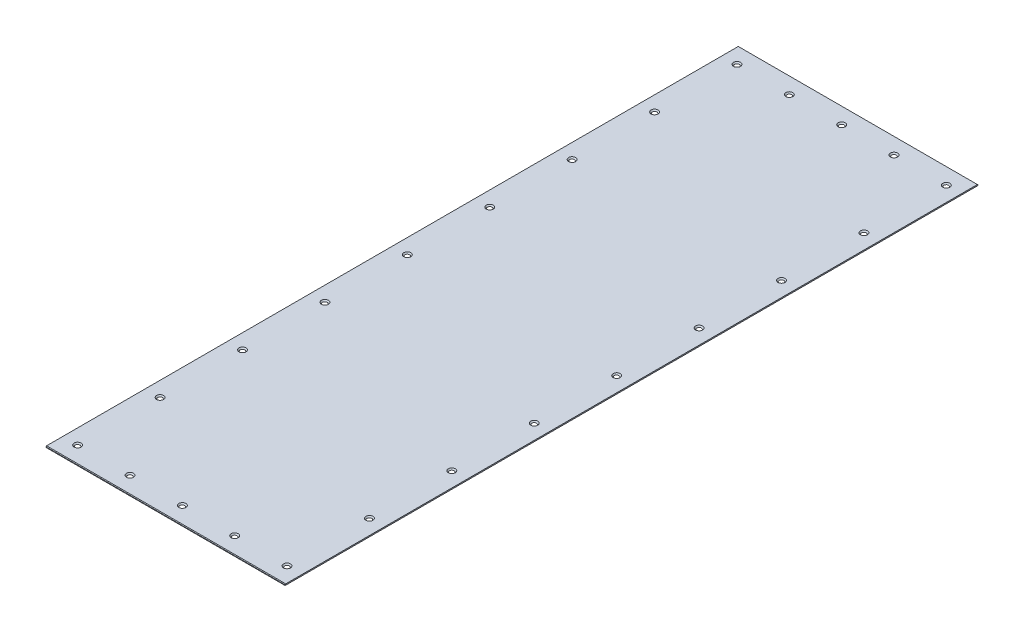
ISO-10303-21;
HEADER;
FILE_DESCRIPTION(('STEP AP214'),'2;1');
FILE_NAME('part.step','',(''),(''),'','','');
FILE_SCHEMA(('AUTOMOTIVE_DESIGN { 1 0 10303 214 1 1 1 1 }'));
ENDSEC;
DATA;
#1=APPLICATION_CONTEXT('core data for automotive mechanical design processes');
#2=APPLICATION_PROTOCOL_DEFINITION('international standard','automotive_design',2000,#1);
#3=PRODUCT_CONTEXT('',#1,'mechanical');
#4=PRODUCT('Part','Part','',(#3));
#5=PRODUCT_RELATED_PRODUCT_CATEGORY('part','',(#4));
#6=PRODUCT_DEFINITION_FORMATION('','',#4);
#7=PRODUCT_DEFINITION_CONTEXT('part definition',#1,'design');
#8=PRODUCT_DEFINITION('design','',#6,#7);
#9=PRODUCT_DEFINITION_SHAPE('','',#8);
#10=(LENGTH_UNIT() NAMED_UNIT(*) SI_UNIT(.MILLI.,.METRE.));
#11=(NAMED_UNIT(*) PLANE_ANGLE_UNIT() SI_UNIT($,.RADIAN.));
#12=(NAMED_UNIT(*) SI_UNIT($,.STERADIAN.) SOLID_ANGLE_UNIT());
#13=UNCERTAINTY_MEASURE_WITH_UNIT(LENGTH_MEASURE(1.E-05),#10,'distance_accuracy_value','');
#14=(GEOMETRIC_REPRESENTATION_CONTEXT(3) GLOBAL_UNCERTAINTY_ASSIGNED_CONTEXT((#13)) GLOBAL_UNIT_ASSIGNED_CONTEXT((#10,
#11,#12)) REPRESENTATION_CONTEXT('',''));
#15=CARTESIAN_POINT('',(0.,0.,0.));
#16=DIRECTION('',(0.,0.,1.));
#17=DIRECTION('',(1.,0.,0.));
#18=AXIS2_PLACEMENT_3D('',#15,#16,#17);
#19=CARTESIAN_POINT('',(160.5,1.5875,-465.));
#20=DIRECTION('',(0.,-1.,0.));
#21=DIRECTION('',(0.,0.,-1.));
#22=AXIS2_PLACEMENT_3D('',#19,#20,#21);
#23=PLANE('',#22);
#24=CARTESIAN_POINT('',(-70.25,1.5875,-442.5));
#25=DIRECTION('',(0.,1.,0.));
#26=DIRECTION('',(0.,0.,1.));
#27=AXIS2_PLACEMENT_3D('',#24,#25,#26);
#28=CIRCLE('',#27,4.7);
#29=CARTESIAN_POINT('',(-70.25,1.5875,-437.8));
#30=VERTEX_POINT('',#29);
#31=EDGE_CURVE('E219',#30,#30,#28,.T.);
#32=ORIENTED_EDGE('',*,*,#31,.F.);
#33=EDGE_LOOP('',(#32));
#34=FACE_BOUND('',#33,.T.);
#35=CARTESIAN_POINT('',(70.25,1.5875,-442.5));
#36=DIRECTION('',(0.,1.,0.));
#37=DIRECTION('',(0.,0.,1.));
#38=AXIS2_PLACEMENT_3D('',#35,#36,#37);
#39=CIRCLE('',#38,4.7);
#40=CARTESIAN_POINT('',(70.25,1.5875,-437.8));
#41=VERTEX_POINT('',#40);
#42=EDGE_CURVE('E213',#41,#41,#39,.T.);
#43=ORIENTED_EDGE('',*,*,#42,.F.);
#44=EDGE_LOOP('',(#43));
#45=FACE_BOUND('',#44,.T.);
#46=CARTESIAN_POINT('',(-140.5,1.5875,-331.875));
#47=DIRECTION('',(0.,1.,0.));
#48=DIRECTION('',(0.,0.,1.));
#49=AXIS2_PLACEMENT_3D('',#46,#47,#48);
#50=CIRCLE('',#49,4.70000000000001);
#51=CARTESIAN_POINT('',(-140.5,1.5875,-327.175));
#52=VERTEX_POINT('',#51);
#53=EDGE_CURVE('E205',#52,#52,#50,.T.);
#54=ORIENTED_EDGE('',*,*,#53,.F.);
#55=EDGE_LOOP('',(#54));
#56=FACE_BOUND('',#55,.T.);
#57=CARTESIAN_POINT('',(140.5,1.5875,-221.25));
#58=DIRECTION('',(0.,1.,0.));
#59=DIRECTION('',(0.,0.,1.));
#60=AXIS2_PLACEMENT_3D('',#57,#58,#59);
#61=CIRCLE('',#60,4.70000000000001);
#62=CARTESIAN_POINT('',(140.5,1.5875,-216.55));
#63=VERTEX_POINT('',#62);
#64=EDGE_CURVE('E193',#63,#63,#61,.T.);
#65=ORIENTED_EDGE('',*,*,#64,.F.);
#66=EDGE_LOOP('',(#65));
#67=FACE_BOUND('',#66,.T.);
#68=CARTESIAN_POINT('',(-140.5,1.5875,-110.625));
#69=DIRECTION('',(0.,1.,0.));
#70=DIRECTION('',(0.,0.,1.));
#71=AXIS2_PLACEMENT_3D('',#68,#69,#70);
#72=CIRCLE('',#71,4.70000000000001);
#73=CARTESIAN_POINT('',(-140.5,1.5875,-105.925));
#74=VERTEX_POINT('',#73);
#75=EDGE_CURVE('E189',#74,#74,#72,.T.);
#76=ORIENTED_EDGE('',*,*,#75,.F.);
#77=EDGE_LOOP('',(#76));
#78=FACE_BOUND('',#77,.T.);
#79=CARTESIAN_POINT('',(140.5,1.5875,0.));
#80=DIRECTION('',(0.,1.,0.));
#81=DIRECTION('',(0.,0.,1.));
#82=AXIS2_PLACEMENT_3D('',#79,#80,#81);
#83=CIRCLE('',#82,4.70000000000001);
#84=CARTESIAN_POINT('',(140.5,1.5875,4.70000000000004));
#85=VERTEX_POINT('',#84);
#86=EDGE_CURVE('E177',#85,#85,#83,.T.);
#87=ORIENTED_EDGE('',*,*,#86,.F.);
#88=EDGE_LOOP('',(#87));
#89=FACE_BOUND('',#88,.T.);
#90=CARTESIAN_POINT('',(-140.5,1.5875,221.25));
#91=DIRECTION('',(0.,1.,0.));
#92=DIRECTION('',(0.,0.,1.));
#93=AXIS2_PLACEMENT_3D('',#90,#91,#92);
#94=CIRCLE('',#93,4.70000000000001);
#95=CARTESIAN_POINT('',(-140.5,1.5875,225.95));
#96=VERTEX_POINT('',#95);
#97=EDGE_CURVE('E169',#96,#96,#94,.T.);
#98=ORIENTED_EDGE('',*,*,#97,.F.);
#99=EDGE_LOOP('',(#98));
#100=FACE_BOUND('',#99,.T.);
#101=CARTESIAN_POINT('',(140.5,1.5875,110.625));
#102=DIRECTION('',(0.,1.,0.));
#103=DIRECTION('',(0.,0.,1.));
#104=AXIS2_PLACEMENT_3D('',#101,#102,#103);
#105=CIRCLE('',#104,4.70000000000001);
#106=CARTESIAN_POINT('',(140.5,1.5875,115.325));
#107=VERTEX_POINT('',#106);
#108=EDGE_CURVE('E161',#107,#107,#105,.T.);
#109=ORIENTED_EDGE('',*,*,#108,.F.);
#110=EDGE_LOOP('',(#109));
#111=FACE_BOUND('',#110,.T.);
#112=CARTESIAN_POINT('',(140.5,1.5875,221.25));
#113=DIRECTION('',(0.,1.,0.));
#114=DIRECTION('',(0.,0.,1.));
#115=AXIS2_PLACEMENT_3D('',#112,#113,#114);
#116=CIRCLE('',#115,4.70000000000001);
#117=CARTESIAN_POINT('',(140.5,1.5875,225.95));
#118=VERTEX_POINT('',#117);
#119=EDGE_CURVE('E157',#118,#118,#116,.T.);
#120=ORIENTED_EDGE('',*,*,#119,.F.);
#121=EDGE_LOOP('',(#120));
#122=FACE_BOUND('',#121,.T.);
#123=CARTESIAN_POINT('',(140.5,1.5875,331.875));
#124=DIRECTION('',(0.,1.,0.));
#125=DIRECTION('',(0.,0.,1.));
#126=AXIS2_PLACEMENT_3D('',#123,#124,#125);
#127=CIRCLE('',#126,4.70000000000001);
#128=CARTESIAN_POINT('',(140.5,1.5875,336.575));
#129=VERTEX_POINT('',#128);
#130=EDGE_CURVE('E153',#129,#129,#127,.T.);
#131=ORIENTED_EDGE('',*,*,#130,.F.);
#132=EDGE_LOOP('',(#131));
#133=FACE_BOUND('',#132,.T.);
#134=CARTESIAN_POINT('',(-140.5,1.5875,442.5));
#135=DIRECTION('',(0.,1.,0.));
#136=DIRECTION('',(0.,0.,1.));
#137=AXIS2_PLACEMENT_3D('',#134,#135,#136);
#138=CIRCLE('',#137,4.70000000000001);
#139=CARTESIAN_POINT('',(-140.5,1.5875,447.2));
#140=VERTEX_POINT('',#139);
#141=EDGE_CURVE('E149',#140,#140,#138,.T.);
#142=ORIENTED_EDGE('',*,*,#141,.F.);
#143=EDGE_LOOP('',(#142));
#144=FACE_BOUND('',#143,.T.);
#145=CARTESIAN_POINT('',(-70.25,1.5875,442.5));
#146=DIRECTION('',(0.,1.,0.));
#147=DIRECTION('',(0.,0.,1.));
#148=AXIS2_PLACEMENT_3D('',#145,#146,#147);
#149=CIRCLE('',#148,4.7);
#150=CARTESIAN_POINT('',(-70.25,1.5875,447.2));
#151=VERTEX_POINT('',#150);
#152=EDGE_CURVE('E145',#151,#151,#149,.T.);
#153=ORIENTED_EDGE('',*,*,#152,.F.);
#154=EDGE_LOOP('',(#153));
#155=FACE_BOUND('',#154,.T.);
#156=CARTESIAN_POINT('',(0.,1.5875,442.5));
#157=DIRECTION('',(0.,1.,0.));
#158=DIRECTION('',(0.,0.,1.));
#159=AXIS2_PLACEMENT_3D('',#156,#157,#158);
#160=CIRCLE('',#159,4.7);
#161=CARTESIAN_POINT('',(0.,1.5875,447.2));
#162=VERTEX_POINT('',#161);
#163=EDGE_CURVE('E141',#162,#162,#160,.T.);
#164=ORIENTED_EDGE('',*,*,#163,.F.);
#165=EDGE_LOOP('',(#164));
#166=FACE_BOUND('',#165,.T.);
#167=CARTESIAN_POINT('',(70.25,1.5875,442.5));
#168=DIRECTION('',(0.,1.,0.));
#169=DIRECTION('',(0.,0.,1.));
#170=AXIS2_PLACEMENT_3D('',#167,#168,#169);
#171=CIRCLE('',#170,4.7);
#172=CARTESIAN_POINT('',(70.25,1.5875,447.2));
#173=VERTEX_POINT('',#172);
#174=EDGE_CURVE('E137',#173,#173,#171,.T.);
#175=ORIENTED_EDGE('',*,*,#174,.F.);
#176=EDGE_LOOP('',(#175));
#177=FACE_BOUND('',#176,.T.);
#178=CARTESIAN_POINT('',(140.5,1.5875,442.5));
#179=DIRECTION('',(0.,1.,0.));
#180=DIRECTION('',(0.,0.,1.));
#181=AXIS2_PLACEMENT_3D('',#178,#179,#180);
#182=CIRCLE('',#181,4.70000000000001);
#183=CARTESIAN_POINT('',(140.5,1.5875,447.2));
#184=VERTEX_POINT('',#183);
#185=EDGE_CURVE('E108',#184,#184,#182,.T.);
#186=ORIENTED_EDGE('',*,*,#185,.F.);
#187=EDGE_LOOP('',(#186));
#188=FACE_BOUND('',#187,.T.);
#189=DIRECTION('',(0.,0.,-1.));
#190=VECTOR('',#189,1.);
#191=CARTESIAN_POINT('',(160.5,1.5875,465.));
#192=LINE('',#191,#190);
#193=CARTESIAN_POINT('',(160.5,1.5875,464.20625));
#194=VERTEX_POINT('',#193);
#195=CARTESIAN_POINT('',(160.5,1.58750000000011,-464.20625));
#196=VERTEX_POINT('',#195);
#197=EDGE_CURVE('E117',#194,#196,#192,.T.);
#198=ORIENTED_EDGE('',*,*,#197,.T.);
#199=DIRECTION('',(-1.,0.,0.));
#200=VECTOR('',#199,1.);
#201=CARTESIAN_POINT('',(160.5,1.5875,-464.20625));
#202=LINE('',#201,#200);
#203=CARTESIAN_POINT('',(-160.5,1.58750000000011,-464.20625));
#204=VERTEX_POINT('',#203);
#205=EDGE_CURVE('E124',#196,#204,#202,.T.);
#206=ORIENTED_EDGE('',*,*,#205,.T.);
#207=DIRECTION('',(0.,0.,1.));
#208=VECTOR('',#207,1.);
#209=CARTESIAN_POINT('',(-160.5,1.5875,465.));
#210=LINE('',#209,#208);
#211=CARTESIAN_POINT('',(-160.5,1.5875,464.20625));
#212=VERTEX_POINT('',#211);
#213=EDGE_CURVE('E111',#204,#212,#210,.T.);
#214=ORIENTED_EDGE('',*,*,#213,.T.);
#215=DIRECTION('',(1.,0.,0.));
#216=VECTOR('',#215,1.);
#217=CARTESIAN_POINT('',(160.5,1.5875,464.20625));
#218=LINE('',#217,#216);
#219=EDGE_CURVE('E91',#212,#194,#218,.T.);
#220=ORIENTED_EDGE('',*,*,#219,.T.);
#221=EDGE_LOOP('',(#198,#206,#214,#220));
#222=FACE_BOUND('',#221,.T.);
#223=CARTESIAN_POINT('',(-140.5,1.5875,331.875));
#224=DIRECTION('',(0.,1.,0.));
#225=DIRECTION('',(0.,0.,1.));
#226=AXIS2_PLACEMENT_3D('',#223,#224,#225);
#227=CIRCLE('',#226,4.70000000000001);
#228=CARTESIAN_POINT('',(-140.5,1.5875,336.575));
#229=VERTEX_POINT('',#228);
#230=EDGE_CURVE('E165',#229,#229,#227,.T.);
#231=ORIENTED_EDGE('',*,*,#230,.F.);
#232=EDGE_LOOP('',(#231));
#233=FACE_BOUND('',#232,.T.);
#234=CARTESIAN_POINT('',(-140.5,1.5875,110.625));
#235=DIRECTION('',(0.,1.,0.));
#236=DIRECTION('',(0.,0.,1.));
#237=AXIS2_PLACEMENT_3D('',#234,#235,#236);
#238=CIRCLE('',#237,4.70000000000001);
#239=CARTESIAN_POINT('',(-140.5,1.5875,115.325));
#240=VERTEX_POINT('',#239);
#241=EDGE_CURVE('E173',#240,#240,#238,.T.);
#242=ORIENTED_EDGE('',*,*,#241,.F.);
#243=EDGE_LOOP('',(#242));
#244=FACE_BOUND('',#243,.T.);
#245=CARTESIAN_POINT('',(-140.5,1.5875,0.));
#246=DIRECTION('',(0.,1.,0.));
#247=DIRECTION('',(0.,0.,1.));
#248=AXIS2_PLACEMENT_3D('',#245,#246,#247);
#249=CIRCLE('',#248,4.70000000000001);
#250=CARTESIAN_POINT('',(-140.5,1.5875,4.70000000000004));
#251=VERTEX_POINT('',#250);
#252=EDGE_CURVE('E181',#251,#251,#249,.T.);
#253=ORIENTED_EDGE('',*,*,#252,.F.);
#254=EDGE_LOOP('',(#253));
#255=FACE_BOUND('',#254,.T.);
#256=CARTESIAN_POINT('',(140.5,1.5875,-110.625));
#257=DIRECTION('',(0.,1.,0.));
#258=DIRECTION('',(0.,0.,1.));
#259=AXIS2_PLACEMENT_3D('',#256,#257,#258);
#260=CIRCLE('',#259,4.70000000000001);
#261=CARTESIAN_POINT('',(140.5,1.5875,-105.925));
#262=VERTEX_POINT('',#261);
#263=EDGE_CURVE('E185',#262,#262,#260,.T.);
#264=ORIENTED_EDGE('',*,*,#263,.F.);
#265=EDGE_LOOP('',(#264));
#266=FACE_BOUND('',#265,.T.);
#267=CARTESIAN_POINT('',(-140.5,1.5875,-221.25));
#268=DIRECTION('',(0.,1.,0.));
#269=DIRECTION('',(0.,0.,1.));
#270=AXIS2_PLACEMENT_3D('',#267,#268,#269);
#271=CIRCLE('',#270,4.70000000000001);
#272=CARTESIAN_POINT('',(-140.5,1.5875,-216.55));
#273=VERTEX_POINT('',#272);
#274=EDGE_CURVE('E197',#273,#273,#271,.T.);
#275=ORIENTED_EDGE('',*,*,#274,.F.);
#276=EDGE_LOOP('',(#275));
#277=FACE_BOUND('',#276,.T.);
#278=CARTESIAN_POINT('',(140.5,1.5875,-331.875));
#279=DIRECTION('',(0.,1.,0.));
#280=DIRECTION('',(0.,0.,1.));
#281=AXIS2_PLACEMENT_3D('',#278,#279,#280);
#282=CIRCLE('',#281,4.70000000000001);
#283=CARTESIAN_POINT('',(140.5,1.5875,-327.175));
#284=VERTEX_POINT('',#283);
#285=EDGE_CURVE('E201',#284,#284,#282,.T.);
#286=ORIENTED_EDGE('',*,*,#285,.F.);
#287=EDGE_LOOP('',(#286));
#288=FACE_BOUND('',#287,.T.);
#289=CARTESIAN_POINT('',(140.5,1.5875,-442.5));
#290=DIRECTION('',(0.,1.,0.));
#291=DIRECTION('',(0.,0.,1.));
#292=AXIS2_PLACEMENT_3D('',#289,#290,#291);
#293=CIRCLE('',#292,4.70000000000001);
#294=CARTESIAN_POINT('',(140.5,1.5875,-437.8));
#295=VERTEX_POINT('',#294);
#296=EDGE_CURVE('E209',#295,#295,#293,.T.);
#297=ORIENTED_EDGE('',*,*,#296,.F.);
#298=EDGE_LOOP('',(#297));
#299=FACE_BOUND('',#298,.T.);
#300=CARTESIAN_POINT('',(0.,1.5875,-442.5));
#301=DIRECTION('',(0.,1.,0.));
#302=DIRECTION('',(0.,0.,1.));
#303=AXIS2_PLACEMENT_3D('',#300,#301,#302);
#304=CIRCLE('',#303,4.7);
#305=CARTESIAN_POINT('',(0.,1.5875,-437.8));
#306=VERTEX_POINT('',#305);
#307=EDGE_CURVE('E216',#306,#306,#304,.T.);
#308=ORIENTED_EDGE('',*,*,#307,.F.);
#309=EDGE_LOOP('',(#308));
#310=FACE_BOUND('',#309,.T.);
#311=CARTESIAN_POINT('',(-140.5,1.5875,-442.5));
#312=DIRECTION('',(0.,1.,0.));
#313=DIRECTION('',(0.,0.,1.));
#314=AXIS2_PLACEMENT_3D('',#311,#312,#313);
#315=CIRCLE('',#314,4.70000000000001);
#316=CARTESIAN_POINT('',(-140.5,1.5875,-437.8));
#317=VERTEX_POINT('',#316);
#318=EDGE_CURVE('E229',#317,#317,#315,.T.);
#319=ORIENTED_EDGE('',*,*,#318,.F.);
#320=EDGE_LOOP('',(#319));
#321=FACE_BOUND('',#320,.T.);
#322=ADVANCED_FACE('F31',(#34,#45,#56,#67,#78,#89,#100,#111,#122,#133,#144,#155,#166,#177,#188,
#222,#233,#244,#255,#266,#277,#288,#299,#310,#321),#23,.F.);
#323=CARTESIAN_POINT('',(160.5,1.5875,465.));
#324=DIRECTION('',(-1.,0.,0.));
#325=DIRECTION('',(0.,0.,1.));
#326=AXIS2_PLACEMENT_3D('',#323,#324,#325);
#327=PLANE('',#326);
#328=DIRECTION('',(0.,-1.,0.));
#329=VECTOR('',#328,1.);
#330=CARTESIAN_POINT('',(160.5,1.5875,-465.));
#331=LINE('',#330,#329);
#332=CARTESIAN_POINT('',(160.5,0.793749999999962,-465.));
#333=VERTEX_POINT('',#332);
#334=CARTESIAN_POINT('',(160.5,0.,-465.));
#335=VERTEX_POINT('',#334);
#336=EDGE_CURVE('E84',#333,#335,#331,.T.);
#337=ORIENTED_EDGE('',*,*,#336,.F.);
#338=DIRECTION('',(0.,-0.707106781186548,-0.707106781186548));
#339=VECTOR('',#338,1.);
#340=CARTESIAN_POINT('',(160.5,1.5875,-464.20625));
#341=LINE('',#340,#339);
#342=EDGE_CURVE('E40',#333,#196,#341,.F.);
#343=ORIENTED_EDGE('',*,*,#342,.T.);
#344=ORIENTED_EDGE('',*,*,#197,.F.);
#345=DIRECTION('',(0.,0.707106781186548,-0.707106781186548));
#346=VECTOR('',#345,1.);
#347=CARTESIAN_POINT('',(160.5,1.5875,464.20625));
#348=LINE('',#347,#346);
#349=CARTESIAN_POINT('',(160.5,0.793749999999962,465.));
#350=VERTEX_POINT('',#349);
#351=EDGE_CURVE('E48',#194,#350,#348,.F.);
#352=ORIENTED_EDGE('',*,*,#351,.T.);
#353=DIRECTION('',(0.,-1.,0.));
#354=VECTOR('',#353,1.);
#355=CARTESIAN_POINT('',(160.5,1.5875,465.));
#356=LINE('',#355,#354);
#357=CARTESIAN_POINT('',(160.5,0.,465.));
#358=VERTEX_POINT('',#357);
#359=EDGE_CURVE('E103',#350,#358,#356,.T.);
#360=ORIENTED_EDGE('',*,*,#359,.T.);
#361=DIRECTION('',(0.,0.,-1.));
#362=VECTOR('',#361,1.);
#363=CARTESIAN_POINT('',(160.5,0.,465.));
#364=LINE('',#363,#362);
#365=EDGE_CURVE('E98',#358,#335,#364,.T.);
#366=ORIENTED_EDGE('',*,*,#365,.T.);
#367=EDGE_LOOP('',(#337,#343,#344,#352,#360,#366));
#368=FACE_BOUND('',#367,.T.);
#369=ADVANCED_FACE('F102',(#368),#327,.F.);
#370=CARTESIAN_POINT('',(-160.5,1.5875,-465.));
#371=DIRECTION('',(0.,0.,1.));
#372=DIRECTION('',(1.,0.,0.));
#373=AXIS2_PLACEMENT_3D('',#370,#371,#372);
#374=PLANE('',#373);
#375=DIRECTION('',(0.,-1.,0.));
#376=VECTOR('',#375,1.);
#377=CARTESIAN_POINT('',(-160.5,1.5875,-465.));
#378=LINE('',#377,#376);
#379=CARTESIAN_POINT('',(-160.5,0.793749999999962,-465.));
#380=VERTEX_POINT('',#379);
#381=CARTESIAN_POINT('',(-160.5,0.,-465.));
#382=VERTEX_POINT('',#381);
#383=EDGE_CURVE('E92',#380,#382,#378,.T.);
#384=ORIENTED_EDGE('',*,*,#383,.F.);
#385=DIRECTION('',(1.,0.,0.));
#386=VECTOR('',#385,1.);
#387=CARTESIAN_POINT('',(-160.5,0.793749999999962,-465.));
#388=LINE('',#387,#386);
#389=EDGE_CURVE('E56',#380,#333,#388,.T.);
#390=ORIENTED_EDGE('',*,*,#389,.T.);
#391=ORIENTED_EDGE('',*,*,#336,.T.);
#392=DIRECTION('',(-1.,0.,0.));
#393=VECTOR('',#392,1.);
#394=CARTESIAN_POINT('',(-160.5,0.,-465.));
#395=LINE('',#394,#393);
#396=EDGE_CURVE('E87',#335,#382,#395,.T.);
#397=ORIENTED_EDGE('',*,*,#396,.T.);
#398=EDGE_LOOP('',(#384,#390,#391,#397));
#399=FACE_BOUND('',#398,.T.);
#400=ADVANCED_FACE('F86',(#399),#374,.F.);
#401=CARTESIAN_POINT('',(-160.5,1.5875,465.));
#402=DIRECTION('',(1.,0.,0.));
#403=DIRECTION('',(0.,0.,-1.));
#404=AXIS2_PLACEMENT_3D('',#401,#402,#403);
#405=PLANE('',#404);
#406=ORIENTED_EDGE('',*,*,#213,.F.);
#407=DIRECTION('',(0.,0.707106781186548,0.707106781186548));
#408=VECTOR('',#407,1.);
#409=CARTESIAN_POINT('',(-160.5,1.5875,-464.20625));
#410=LINE('',#409,#408);
#411=EDGE_CURVE('E129',#204,#380,#410,.F.);
#412=ORIENTED_EDGE('',*,*,#411,.T.);
#413=ORIENTED_EDGE('',*,*,#383,.T.);
#414=DIRECTION('',(0.,0.,1.));
#415=VECTOR('',#414,1.);
#416=CARTESIAN_POINT('',(-160.5,0.,465.));
#417=LINE('',#416,#415);
#418=CARTESIAN_POINT('',(-160.5,0.,465.));
#419=VERTEX_POINT('',#418);
#420=EDGE_CURVE('E100',#382,#419,#417,.T.);
#421=ORIENTED_EDGE('',*,*,#420,.T.);
#422=DIRECTION('',(0.,-1.,0.));
#423=VECTOR('',#422,1.);
#424=CARTESIAN_POINT('',(-160.5,1.5875,465.));
#425=LINE('',#424,#423);
#426=CARTESIAN_POINT('',(-160.5,0.793749999999962,465.));
#427=VERTEX_POINT('',#426);
#428=EDGE_CURVE('E119',#427,#419,#425,.T.);
#429=ORIENTED_EDGE('',*,*,#428,.F.);
#430=DIRECTION('',(0.,-0.707106781186548,0.707106781186548));
#431=VECTOR('',#430,1.);
#432=CARTESIAN_POINT('',(-160.5,1.5875,464.20625));
#433=LINE('',#432,#431);
#434=EDGE_CURVE('E127',#427,#212,#433,.F.);
#435=ORIENTED_EDGE('',*,*,#434,.T.);
#436=EDGE_LOOP('',(#406,#412,#413,#421,#429,#435));
#437=FACE_BOUND('',#436,.T.);
#438=ADVANCED_FACE('F287',(#437),#405,.F.);
#439=CARTESIAN_POINT('',(-160.5,1.5875,465.));
#440=DIRECTION('',(0.,0.,-1.));
#441=DIRECTION('',(-1.,0.,0.));
#442=AXIS2_PLACEMENT_3D('',#439,#440,#441);
#443=PLANE('',#442);
#444=ORIENTED_EDGE('',*,*,#359,.F.);
#445=DIRECTION('',(-1.,0.,0.));
#446=VECTOR('',#445,1.);
#447=CARTESIAN_POINT('',(-160.5,0.793749999999962,465.));
#448=LINE('',#447,#446);
#449=EDGE_CURVE('E11',#350,#427,#448,.T.);
#450=ORIENTED_EDGE('',*,*,#449,.T.);
#451=ORIENTED_EDGE('',*,*,#428,.T.);
#452=DIRECTION('',(1.,0.,0.));
#453=VECTOR('',#452,1.);
#454=CARTESIAN_POINT('',(-160.5,0.,465.));
#455=LINE('',#454,#453);
#456=EDGE_CURVE('E115',#419,#358,#455,.T.);
#457=ORIENTED_EDGE('',*,*,#456,.T.);
#458=EDGE_LOOP('',(#444,#450,#451,#457));
#459=FACE_BOUND('',#458,.T.);
#460=ADVANCED_FACE('F286',(#459),#443,.F.);
#461=CARTESIAN_POINT('',(160.5,0.,-465.));
#462=DIRECTION('',(0.,-1.,0.));
#463=DIRECTION('',(0.,0.,-1.));
#464=AXIS2_PLACEMENT_3D('',#461,#462,#463);
#465=PLANE('',#464);
#466=CARTESIAN_POINT('',(-140.5,0.,-442.5));
#467=DIRECTION('',(0.,-1.,0.));
#468=DIRECTION('',(0.,0.,-1.));
#469=AXIS2_PLACEMENT_3D('',#466,#467,#468);
#470=CIRCLE('',#469,3.11250000000001);
#471=CARTESIAN_POINT('',(-140.5,0.,-445.6125));
#472=VERTEX_POINT('',#471);
#473=EDGE_CURVE('E35',#472,#472,#470,.T.);
#474=ORIENTED_EDGE('',*,*,#473,.F.);
#475=EDGE_LOOP('',(#474));
#476=FACE_BOUND('',#475,.T.);
#477=CARTESIAN_POINT('',(-70.25,0.,-442.5));
#478=DIRECTION('',(0.,-1.,0.));
#479=DIRECTION('',(0.,0.,-1.));
#480=AXIS2_PLACEMENT_3D('',#477,#478,#479);
#481=CIRCLE('',#480,3.1125);
#482=CARTESIAN_POINT('',(-70.25,0.,-445.6125));
#483=VERTEX_POINT('',#482);
#484=EDGE_CURVE('E217',#483,#483,#481,.T.);
#485=ORIENTED_EDGE('',*,*,#484,.F.);
#486=EDGE_LOOP('',(#485));
#487=FACE_BOUND('',#486,.T.);
#488=CARTESIAN_POINT('',(0.,0.,-442.5));
#489=DIRECTION('',(0.,-1.,0.));
#490=DIRECTION('',(0.,0.,-1.));
#491=AXIS2_PLACEMENT_3D('',#488,#489,#490);
#492=CIRCLE('',#491,3.1125);
#493=CARTESIAN_POINT('',(0.,0.,-445.6125));
#494=VERTEX_POINT('',#493);
#495=EDGE_CURVE('E214',#494,#494,#492,.T.);
#496=ORIENTED_EDGE('',*,*,#495,.F.);
#497=EDGE_LOOP('',(#496));
#498=FACE_BOUND('',#497,.T.);
#499=CARTESIAN_POINT('',(70.25,0.,-442.5));
#500=DIRECTION('',(0.,-1.,0.));
#501=DIRECTION('',(0.,0.,-1.));
#502=AXIS2_PLACEMENT_3D('',#499,#500,#501);
#503=CIRCLE('',#502,3.1125);
#504=CARTESIAN_POINT('',(70.25,0.,-445.6125));
#505=VERTEX_POINT('',#504);
#506=EDGE_CURVE('E210',#505,#505,#503,.T.);
#507=ORIENTED_EDGE('',*,*,#506,.F.);
#508=EDGE_LOOP('',(#507));
#509=FACE_BOUND('',#508,.T.);
#510=CARTESIAN_POINT('',(140.5,0.,-442.5));
#511=DIRECTION('',(0.,-1.,0.));
#512=DIRECTION('',(0.,0.,-1.));
#513=AXIS2_PLACEMENT_3D('',#510,#511,#512);
#514=CIRCLE('',#513,3.11250000000001);
#515=CARTESIAN_POINT('',(140.5,0.,-445.6125));
#516=VERTEX_POINT('',#515);
#517=EDGE_CURVE('E206',#516,#516,#514,.T.);
#518=ORIENTED_EDGE('',*,*,#517,.F.);
#519=EDGE_LOOP('',(#518));
#520=FACE_BOUND('',#519,.T.);
#521=CARTESIAN_POINT('',(-140.5,0.,-331.875));
#522=DIRECTION('',(0.,-1.,0.));
#523=DIRECTION('',(0.,0.,-1.));
#524=AXIS2_PLACEMENT_3D('',#521,#522,#523);
#525=CIRCLE('',#524,3.11250000000001);
#526=CARTESIAN_POINT('',(-140.5,0.,-334.9875));
#527=VERTEX_POINT('',#526);
#528=EDGE_CURVE('E202',#527,#527,#525,.T.);
#529=ORIENTED_EDGE('',*,*,#528,.F.);
#530=EDGE_LOOP('',(#529));
#531=FACE_BOUND('',#530,.T.);
#532=CARTESIAN_POINT('',(140.5,0.,-331.875));
#533=DIRECTION('',(0.,-1.,0.));
#534=DIRECTION('',(0.,0.,-1.));
#535=AXIS2_PLACEMENT_3D('',#532,#533,#534);
#536=CIRCLE('',#535,3.11250000000001);
#537=CARTESIAN_POINT('',(140.5,0.,-334.9875));
#538=VERTEX_POINT('',#537);
#539=EDGE_CURVE('E198',#538,#538,#536,.T.);
#540=ORIENTED_EDGE('',*,*,#539,.F.);
#541=EDGE_LOOP('',(#540));
#542=FACE_BOUND('',#541,.T.);
#543=CARTESIAN_POINT('',(-140.5,0.,-221.25));
#544=DIRECTION('',(0.,-1.,0.));
#545=DIRECTION('',(0.,0.,-1.));
#546=AXIS2_PLACEMENT_3D('',#543,#544,#545);
#547=CIRCLE('',#546,3.11250000000001);
#548=CARTESIAN_POINT('',(-140.5,0.,-224.3625));
#549=VERTEX_POINT('',#548);
#550=EDGE_CURVE('E194',#549,#549,#547,.T.);
#551=ORIENTED_EDGE('',*,*,#550,.F.);
#552=EDGE_LOOP('',(#551));
#553=FACE_BOUND('',#552,.T.);
#554=CARTESIAN_POINT('',(140.5,0.,-221.25));
#555=DIRECTION('',(0.,-1.,0.));
#556=DIRECTION('',(0.,0.,-1.));
#557=AXIS2_PLACEMENT_3D('',#554,#555,#556);
#558=CIRCLE('',#557,3.11250000000001);
#559=CARTESIAN_POINT('',(140.5,0.,-224.3625));
#560=VERTEX_POINT('',#559);
#561=EDGE_CURVE('E190',#560,#560,#558,.T.);
#562=ORIENTED_EDGE('',*,*,#561,.F.);
#563=EDGE_LOOP('',(#562));
#564=FACE_BOUND('',#563,.T.);
#565=CARTESIAN_POINT('',(-140.5,0.,-110.625));
#566=DIRECTION('',(0.,-1.,0.));
#567=DIRECTION('',(0.,0.,-1.));
#568=AXIS2_PLACEMENT_3D('',#565,#566,#567);
#569=CIRCLE('',#568,3.11250000000001);
#570=CARTESIAN_POINT('',(-140.5,0.,-113.7375));
#571=VERTEX_POINT('',#570);
#572=EDGE_CURVE('E186',#571,#571,#569,.T.);
#573=ORIENTED_EDGE('',*,*,#572,.F.);
#574=EDGE_LOOP('',(#573));
#575=FACE_BOUND('',#574,.T.);
#576=CARTESIAN_POINT('',(140.5,0.,-110.625));
#577=DIRECTION('',(0.,-1.,0.));
#578=DIRECTION('',(0.,0.,-1.));
#579=AXIS2_PLACEMENT_3D('',#576,#577,#578);
#580=CIRCLE('',#579,3.11250000000001);
#581=CARTESIAN_POINT('',(140.5,0.,-113.7375));
#582=VERTEX_POINT('',#581);
#583=EDGE_CURVE('E182',#582,#582,#580,.T.);
#584=ORIENTED_EDGE('',*,*,#583,.F.);
#585=EDGE_LOOP('',(#584));
#586=FACE_BOUND('',#585,.T.);
#587=CARTESIAN_POINT('',(-140.5,0.,0.));
#588=DIRECTION('',(0.,-1.,0.));
#589=DIRECTION('',(0.,0.,-1.));
#590=AXIS2_PLACEMENT_3D('',#587,#588,#589);
#591=CIRCLE('',#590,3.11250000000001);
#592=CARTESIAN_POINT('',(-140.5,0.,-3.11249999999998));
#593=VERTEX_POINT('',#592);
#594=EDGE_CURVE('E178',#593,#593,#591,.T.);
#595=ORIENTED_EDGE('',*,*,#594,.F.);
#596=EDGE_LOOP('',(#595));
#597=FACE_BOUND('',#596,.T.);
#598=CARTESIAN_POINT('',(140.5,0.,0.));
#599=DIRECTION('',(0.,-1.,0.));
#600=DIRECTION('',(0.,0.,-1.));
#601=AXIS2_PLACEMENT_3D('',#598,#599,#600);
#602=CIRCLE('',#601,3.11250000000001);
#603=CARTESIAN_POINT('',(140.5,0.,-3.11249999999998));
#604=VERTEX_POINT('',#603);
#605=EDGE_CURVE('E174',#604,#604,#602,.T.);
#606=ORIENTED_EDGE('',*,*,#605,.F.);
#607=EDGE_LOOP('',(#606));
#608=FACE_BOUND('',#607,.T.);
#609=CARTESIAN_POINT('',(-140.5,0.,110.625));
#610=DIRECTION('',(0.,-1.,0.));
#611=DIRECTION('',(0.,0.,-1.));
#612=AXIS2_PLACEMENT_3D('',#609,#610,#611);
#613=CIRCLE('',#612,3.11250000000001);
#614=CARTESIAN_POINT('',(-140.5,0.,107.5125));
#615=VERTEX_POINT('',#614);
#616=EDGE_CURVE('E170',#615,#615,#613,.T.);
#617=ORIENTED_EDGE('',*,*,#616,.F.);
#618=EDGE_LOOP('',(#617));
#619=FACE_BOUND('',#618,.T.);
#620=CARTESIAN_POINT('',(-140.5,0.,221.25));
#621=DIRECTION('',(0.,-1.,0.));
#622=DIRECTION('',(0.,0.,-1.));
#623=AXIS2_PLACEMENT_3D('',#620,#621,#622);
#624=CIRCLE('',#623,3.11250000000001);
#625=CARTESIAN_POINT('',(-140.5,0.,218.1375));
#626=VERTEX_POINT('',#625);
#627=EDGE_CURVE('E166',#626,#626,#624,.T.);
#628=ORIENTED_EDGE('',*,*,#627,.F.);
#629=EDGE_LOOP('',(#628));
#630=FACE_BOUND('',#629,.T.);
#631=CARTESIAN_POINT('',(-140.5,0.,331.875));
#632=DIRECTION('',(0.,-1.,0.));
#633=DIRECTION('',(0.,0.,-1.));
#634=AXIS2_PLACEMENT_3D('',#631,#632,#633);
#635=CIRCLE('',#634,3.11250000000001);
#636=CARTESIAN_POINT('',(-140.5,0.,328.7625));
#637=VERTEX_POINT('',#636);
#638=EDGE_CURVE('E162',#637,#637,#635,.T.);
#639=ORIENTED_EDGE('',*,*,#638,.F.);
#640=EDGE_LOOP('',(#639));
#641=FACE_BOUND('',#640,.T.);
#642=CARTESIAN_POINT('',(140.5,0.,110.625));
#643=DIRECTION('',(0.,-1.,0.));
#644=DIRECTION('',(0.,0.,-1.));
#645=AXIS2_PLACEMENT_3D('',#642,#643,#644);
#646=CIRCLE('',#645,3.11250000000001);
#647=CARTESIAN_POINT('',(140.5,0.,107.5125));
#648=VERTEX_POINT('',#647);
#649=EDGE_CURVE('E158',#648,#648,#646,.T.);
#650=ORIENTED_EDGE('',*,*,#649,.F.);
#651=EDGE_LOOP('',(#650));
#652=FACE_BOUND('',#651,.T.);
#653=CARTESIAN_POINT('',(140.5,0.,221.25));
#654=DIRECTION('',(0.,-1.,0.));
#655=DIRECTION('',(0.,0.,-1.));
#656=AXIS2_PLACEMENT_3D('',#653,#654,#655);
#657=CIRCLE('',#656,3.11250000000001);
#658=CARTESIAN_POINT('',(140.5,0.,218.1375));
#659=VERTEX_POINT('',#658);
#660=EDGE_CURVE('E154',#659,#659,#657,.T.);
#661=ORIENTED_EDGE('',*,*,#660,.F.);
#662=EDGE_LOOP('',(#661));
#663=FACE_BOUND('',#662,.T.);
#664=CARTESIAN_POINT('',(140.5,0.,331.875));
#665=DIRECTION('',(0.,-1.,0.));
#666=DIRECTION('',(0.,0.,-1.));
#667=AXIS2_PLACEMENT_3D('',#664,#665,#666);
#668=CIRCLE('',#667,3.11250000000001);
#669=CARTESIAN_POINT('',(140.5,0.,328.7625));
#670=VERTEX_POINT('',#669);
#671=EDGE_CURVE('E150',#670,#670,#668,.T.);
#672=ORIENTED_EDGE('',*,*,#671,.F.);
#673=EDGE_LOOP('',(#672));
#674=FACE_BOUND('',#673,.T.);
#675=CARTESIAN_POINT('',(-140.5,0.,442.5));
#676=DIRECTION('',(0.,-1.,0.));
#677=DIRECTION('',(0.,0.,-1.));
#678=AXIS2_PLACEMENT_3D('',#675,#676,#677);
#679=CIRCLE('',#678,3.11250000000001);
#680=CARTESIAN_POINT('',(-140.5,0.,439.3875));
#681=VERTEX_POINT('',#680);
#682=EDGE_CURVE('E146',#681,#681,#679,.T.);
#683=ORIENTED_EDGE('',*,*,#682,.F.);
#684=EDGE_LOOP('',(#683));
#685=FACE_BOUND('',#684,.T.);
#686=CARTESIAN_POINT('',(-70.25,0.,442.5));
#687=DIRECTION('',(0.,-1.,0.));
#688=DIRECTION('',(0.,0.,-1.));
#689=AXIS2_PLACEMENT_3D('',#686,#687,#688);
#690=CIRCLE('',#689,3.1125);
#691=CARTESIAN_POINT('',(-70.25,0.,439.3875));
#692=VERTEX_POINT('',#691);
#693=EDGE_CURVE('E142',#692,#692,#690,.T.);
#694=ORIENTED_EDGE('',*,*,#693,.F.);
#695=EDGE_LOOP('',(#694));
#696=FACE_BOUND('',#695,.T.);
#697=CARTESIAN_POINT('',(0.,0.,442.5));
#698=DIRECTION('',(0.,-1.,0.));
#699=DIRECTION('',(0.,0.,-1.));
#700=AXIS2_PLACEMENT_3D('',#697,#698,#699);
#701=CIRCLE('',#700,3.1125);
#702=CARTESIAN_POINT('',(0.,0.,439.3875));
#703=VERTEX_POINT('',#702);
#704=EDGE_CURVE('E138',#703,#703,#701,.T.);
#705=ORIENTED_EDGE('',*,*,#704,.F.);
#706=EDGE_LOOP('',(#705));
#707=FACE_BOUND('',#706,.T.);
#708=CARTESIAN_POINT('',(70.25,0.,442.5));
#709=DIRECTION('',(0.,-1.,0.));
#710=DIRECTION('',(0.,0.,-1.));
#711=AXIS2_PLACEMENT_3D('',#708,#709,#710);
#712=CIRCLE('',#711,3.1125);
#713=CARTESIAN_POINT('',(70.25,0.,439.3875));
#714=VERTEX_POINT('',#713);
#715=EDGE_CURVE('E134',#714,#714,#712,.T.);
#716=ORIENTED_EDGE('',*,*,#715,.F.);
#717=EDGE_LOOP('',(#716));
#718=FACE_BOUND('',#717,.T.);
#719=CARTESIAN_POINT('',(140.5,0.,442.5));
#720=DIRECTION('',(0.,-1.,0.));
#721=DIRECTION('',(0.,0.,-1.));
#722=AXIS2_PLACEMENT_3D('',#719,#720,#721);
#723=CIRCLE('',#722,3.11250000000001);
#724=CARTESIAN_POINT('',(140.5,0.,439.3875));
#725=VERTEX_POINT('',#724);
#726=EDGE_CURVE('E105',#725,#725,#723,.T.);
#727=ORIENTED_EDGE('',*,*,#726,.F.);
#728=EDGE_LOOP('',(#727));
#729=FACE_BOUND('',#728,.T.);
#730=ORIENTED_EDGE('',*,*,#365,.F.);
#731=ORIENTED_EDGE('',*,*,#456,.F.);
#732=ORIENTED_EDGE('',*,*,#420,.F.);
#733=ORIENTED_EDGE('',*,*,#396,.F.);
#734=EDGE_LOOP('',(#730,#731,#732,#733));
#735=FACE_BOUND('',#734,.T.);
#736=ADVANCED_FACE('F96',(#476,#487,#498,#509,#520,#531,#542,#553,#564,#575,#586,#597,#608,#619,
#630,#641,#652,#663,#674,#685,#696,#707,#718,#729,#735),#465,.T.);
#737=CARTESIAN_POINT('',(160.5,1.5875,-464.20625));
#738=DIRECTION('',(0.,-0.707106781186548,0.707106781186548));
#739=DIRECTION('',(0.,-0.707106781186548,-0.707106781186548));
#740=AXIS2_PLACEMENT_3D('',#737,#738,#739);
#741=PLANE('',#740);
#742=ORIENTED_EDGE('',*,*,#342,.F.);
#743=ORIENTED_EDGE('',*,*,#389,.F.);
#744=ORIENTED_EDGE('',*,*,#411,.F.);
#745=ORIENTED_EDGE('',*,*,#205,.F.);
#746=EDGE_LOOP('',(#742,#743,#744,#745));
#747=FACE_BOUND('',#746,.T.);
#748=ADVANCED_FACE('F289',(#747),#741,.F.);
#749=CARTESIAN_POINT('',(160.5,1.5875,464.20625));
#750=DIRECTION('',(0.,-0.707106781186548,-0.707106781186548));
#751=DIRECTION('',(0.,0.707106781186548,-0.707106781186548));
#752=AXIS2_PLACEMENT_3D('',#749,#750,#751);
#753=PLANE('',#752);
#754=ORIENTED_EDGE('',*,*,#434,.F.);
#755=ORIENTED_EDGE('',*,*,#449,.F.);
#756=ORIENTED_EDGE('',*,*,#351,.F.);
#757=ORIENTED_EDGE('',*,*,#219,.F.);
#758=EDGE_LOOP('',(#754,#755,#756,#757));
#759=FACE_BOUND('',#758,.T.);
#760=ADVANCED_FACE('F33',(#759),#753,.F.);
#761=CARTESIAN_POINT('',(140.5,1.5875,442.5));
#762=DIRECTION('',(0.,1.,0.));
#763=DIRECTION('',(0.,0.,1.));
#764=AXIS2_PLACEMENT_3D('',#761,#762,#763);
#765=CONICAL_SURFACE('',#764,4.70000000000001,0.785398163397449);
#766=ORIENTED_EDGE('',*,*,#726,.T.);
#767=EDGE_LOOP('',(#766));
#768=FACE_BOUND('',#767,.T.);
#769=ORIENTED_EDGE('',*,*,#185,.T.);
#770=EDGE_LOOP('',(#769));
#771=FACE_BOUND('',#770,.T.);
#772=ADVANCED_FACE('F295',(#768,#771),#765,.F.);
#773=CARTESIAN_POINT('',(70.25,1.5875,442.5));
#774=DIRECTION('',(0.,1.,0.));
#775=DIRECTION('',(0.,0.,1.));
#776=AXIS2_PLACEMENT_3D('',#773,#774,#775);
#777=CONICAL_SURFACE('',#776,4.7,0.785398163397446);
#778=ORIENTED_EDGE('',*,*,#715,.T.);
#779=EDGE_LOOP('',(#778));
#780=FACE_BOUND('',#779,.T.);
#781=ORIENTED_EDGE('',*,*,#174,.T.);
#782=EDGE_LOOP('',(#781));
#783=FACE_BOUND('',#782,.T.);
#784=ADVANCED_FACE('F343',(#780,#783),#777,.F.);
#785=CARTESIAN_POINT('',(0.,1.5875,442.5));
#786=DIRECTION('',(0.,1.,0.));
#787=DIRECTION('',(0.,0.,1.));
#788=AXIS2_PLACEMENT_3D('',#785,#786,#787);
#789=CONICAL_SURFACE('',#788,4.7,0.785398163397448);
#790=ORIENTED_EDGE('',*,*,#704,.T.);
#791=EDGE_LOOP('',(#790));
#792=FACE_BOUND('',#791,.T.);
#793=ORIENTED_EDGE('',*,*,#163,.T.);
#794=EDGE_LOOP('',(#793));
#795=FACE_BOUND('',#794,.T.);
#796=ADVANCED_FACE('F352',(#792,#795),#789,.F.);
#797=CARTESIAN_POINT('',(-70.25,1.5875,442.5));
#798=DIRECTION('',(0.,1.,0.));
#799=DIRECTION('',(0.,0.,1.));
#800=AXIS2_PLACEMENT_3D('',#797,#798,#799);
#801=CONICAL_SURFACE('',#800,4.7,0.785398163397446);
#802=ORIENTED_EDGE('',*,*,#693,.T.);
#803=EDGE_LOOP('',(#802));
#804=FACE_BOUND('',#803,.T.);
#805=ORIENTED_EDGE('',*,*,#152,.T.);
#806=EDGE_LOOP('',(#805));
#807=FACE_BOUND('',#806,.T.);
#808=ADVANCED_FACE('F361',(#804,#807),#801,.F.);
#809=CARTESIAN_POINT('',(-140.5,1.5875,442.5));
#810=DIRECTION('',(0.,1.,0.));
#811=DIRECTION('',(0.,0.,1.));
#812=AXIS2_PLACEMENT_3D('',#809,#810,#811);
#813=CONICAL_SURFACE('',#812,4.70000000000001,0.785398163397449);
#814=ORIENTED_EDGE('',*,*,#682,.T.);
#815=EDGE_LOOP('',(#814));
#816=FACE_BOUND('',#815,.T.);
#817=ORIENTED_EDGE('',*,*,#141,.T.);
#818=EDGE_LOOP('',(#817));
#819=FACE_BOUND('',#818,.T.);
#820=ADVANCED_FACE('F371',(#816,#819),#813,.F.);
#821=CARTESIAN_POINT('',(140.5,1.5875,331.875));
#822=DIRECTION('',(0.,1.,0.));
#823=DIRECTION('',(0.,0.,1.));
#824=AXIS2_PLACEMENT_3D('',#821,#822,#823);
#825=CONICAL_SURFACE('',#824,4.70000000000001,0.785398163397449);
#826=ORIENTED_EDGE('',*,*,#671,.T.);
#827=EDGE_LOOP('',(#826));
#828=FACE_BOUND('',#827,.T.);
#829=ORIENTED_EDGE('',*,*,#130,.T.);
#830=EDGE_LOOP('',(#829));
#831=FACE_BOUND('',#830,.T.);
#832=ADVANCED_FACE('F381',(#828,#831),#825,.F.);
#833=CARTESIAN_POINT('',(140.5,1.5875,221.25));
#834=DIRECTION('',(0.,1.,0.));
#835=DIRECTION('',(0.,0.,1.));
#836=AXIS2_PLACEMENT_3D('',#833,#834,#835);
#837=CONICAL_SURFACE('',#836,4.70000000000001,0.785398163397449);
#838=ORIENTED_EDGE('',*,*,#660,.T.);
#839=EDGE_LOOP('',(#838));
#840=FACE_BOUND('',#839,.T.);
#841=ORIENTED_EDGE('',*,*,#119,.T.);
#842=EDGE_LOOP('',(#841));
#843=FACE_BOUND('',#842,.T.);
#844=ADVANCED_FACE('F391',(#840,#843),#837,.F.);
#845=CARTESIAN_POINT('',(140.5,1.5875,110.625));
#846=DIRECTION('',(0.,1.,0.));
#847=DIRECTION('',(0.,0.,1.));
#848=AXIS2_PLACEMENT_3D('',#845,#846,#847);
#849=CONICAL_SURFACE('',#848,4.70000000000001,0.785398163397449);
#850=ORIENTED_EDGE('',*,*,#649,.T.);
#851=EDGE_LOOP('',(#850));
#852=FACE_BOUND('',#851,.T.);
#853=ORIENTED_EDGE('',*,*,#108,.T.);
#854=EDGE_LOOP('',(#853));
#855=FACE_BOUND('',#854,.T.);
#856=ADVANCED_FACE('F401',(#852,#855),#849,.F.);
#857=CARTESIAN_POINT('',(-140.5,1.5875,331.875));
#858=DIRECTION('',(0.,1.,0.));
#859=DIRECTION('',(0.,0.,1.));
#860=AXIS2_PLACEMENT_3D('',#857,#858,#859);
#861=CONICAL_SURFACE('',#860,4.70000000000001,0.785398163397449);
#862=ORIENTED_EDGE('',*,*,#638,.T.);
#863=EDGE_LOOP('',(#862));
#864=FACE_BOUND('',#863,.T.);
#865=ORIENTED_EDGE('',*,*,#230,.T.);
#866=EDGE_LOOP('',(#865));
#867=FACE_BOUND('',#866,.T.);
#868=ADVANCED_FACE('F411',(#864,#867),#861,.F.);
#869=CARTESIAN_POINT('',(-140.5,1.5875,221.25));
#870=DIRECTION('',(0.,1.,0.));
#871=DIRECTION('',(0.,0.,1.));
#872=AXIS2_PLACEMENT_3D('',#869,#870,#871);
#873=CONICAL_SURFACE('',#872,4.70000000000001,0.785398163397449);
#874=ORIENTED_EDGE('',*,*,#627,.T.);
#875=EDGE_LOOP('',(#874));
#876=FACE_BOUND('',#875,.T.);
#877=ORIENTED_EDGE('',*,*,#97,.T.);
#878=EDGE_LOOP('',(#877));
#879=FACE_BOUND('',#878,.T.);
#880=ADVANCED_FACE('F421',(#876,#879),#873,.F.);
#881=CARTESIAN_POINT('',(-140.5,1.5875,110.625));
#882=DIRECTION('',(0.,1.,0.));
#883=DIRECTION('',(0.,0.,1.));
#884=AXIS2_PLACEMENT_3D('',#881,#882,#883);
#885=CONICAL_SURFACE('',#884,4.70000000000001,0.785398163397449);
#886=ORIENTED_EDGE('',*,*,#616,.T.);
#887=EDGE_LOOP('',(#886));
#888=FACE_BOUND('',#887,.T.);
#889=ORIENTED_EDGE('',*,*,#241,.T.);
#890=EDGE_LOOP('',(#889));
#891=FACE_BOUND('',#890,.T.);
#892=ADVANCED_FACE('F431',(#888,#891),#885,.F.);
#893=CARTESIAN_POINT('',(140.5,1.5875,0.));
#894=DIRECTION('',(0.,1.,0.));
#895=DIRECTION('',(0.,0.,1.));
#896=AXIS2_PLACEMENT_3D('',#893,#894,#895);
#897=CONICAL_SURFACE('',#896,4.70000000000001,0.785398163397449);
#898=ORIENTED_EDGE('',*,*,#605,.T.);
#899=EDGE_LOOP('',(#898));
#900=FACE_BOUND('',#899,.T.);
#901=ORIENTED_EDGE('',*,*,#86,.T.);
#902=EDGE_LOOP('',(#901));
#903=FACE_BOUND('',#902,.T.);
#904=ADVANCED_FACE('F441',(#900,#903),#897,.F.);
#905=CARTESIAN_POINT('',(-140.5,1.5875,0.));
#906=DIRECTION('',(0.,1.,0.));
#907=DIRECTION('',(0.,0.,1.));
#908=AXIS2_PLACEMENT_3D('',#905,#906,#907);
#909=CONICAL_SURFACE('',#908,4.70000000000001,0.785398163397449);
#910=ORIENTED_EDGE('',*,*,#594,.T.);
#911=EDGE_LOOP('',(#910));
#912=FACE_BOUND('',#911,.T.);
#913=ORIENTED_EDGE('',*,*,#252,.T.);
#914=EDGE_LOOP('',(#913));
#915=FACE_BOUND('',#914,.T.);
#916=ADVANCED_FACE('F451',(#912,#915),#909,.F.);
#917=CARTESIAN_POINT('',(140.5,1.5875,-110.625));
#918=DIRECTION('',(0.,1.,0.));
#919=DIRECTION('',(0.,0.,1.));
#920=AXIS2_PLACEMENT_3D('',#917,#918,#919);
#921=CONICAL_SURFACE('',#920,4.70000000000001,0.785398163397449);
#922=ORIENTED_EDGE('',*,*,#583,.T.);
#923=EDGE_LOOP('',(#922));
#924=FACE_BOUND('',#923,.T.);
#925=ORIENTED_EDGE('',*,*,#263,.T.);
#926=EDGE_LOOP('',(#925));
#927=FACE_BOUND('',#926,.T.);
#928=ADVANCED_FACE('F461',(#924,#927),#921,.F.);
#929=CARTESIAN_POINT('',(-140.5,1.5875,-110.625));
#930=DIRECTION('',(0.,1.,0.));
#931=DIRECTION('',(0.,0.,1.));
#932=AXIS2_PLACEMENT_3D('',#929,#930,#931);
#933=CONICAL_SURFACE('',#932,4.70000000000001,0.785398163397449);
#934=ORIENTED_EDGE('',*,*,#572,.T.);
#935=EDGE_LOOP('',(#934));
#936=FACE_BOUND('',#935,.T.);
#937=ORIENTED_EDGE('',*,*,#75,.T.);
#938=EDGE_LOOP('',(#937));
#939=FACE_BOUND('',#938,.T.);
#940=ADVANCED_FACE('F471',(#936,#939),#933,.F.);
#941=CARTESIAN_POINT('',(140.5,1.5875,-221.25));
#942=DIRECTION('',(0.,1.,0.));
#943=DIRECTION('',(0.,0.,1.));
#944=AXIS2_PLACEMENT_3D('',#941,#942,#943);
#945=CONICAL_SURFACE('',#944,4.70000000000001,0.785398163397449);
#946=ORIENTED_EDGE('',*,*,#561,.T.);
#947=EDGE_LOOP('',(#946));
#948=FACE_BOUND('',#947,.T.);
#949=ORIENTED_EDGE('',*,*,#64,.T.);
#950=EDGE_LOOP('',(#949));
#951=FACE_BOUND('',#950,.T.);
#952=ADVANCED_FACE('F481',(#948,#951),#945,.F.);
#953=CARTESIAN_POINT('',(-140.5,1.5875,-221.25));
#954=DIRECTION('',(0.,1.,0.));
#955=DIRECTION('',(0.,0.,1.));
#956=AXIS2_PLACEMENT_3D('',#953,#954,#955);
#957=CONICAL_SURFACE('',#956,4.70000000000001,0.785398163397449);
#958=ORIENTED_EDGE('',*,*,#550,.T.);
#959=EDGE_LOOP('',(#958));
#960=FACE_BOUND('',#959,.T.);
#961=ORIENTED_EDGE('',*,*,#274,.T.);
#962=EDGE_LOOP('',(#961));
#963=FACE_BOUND('',#962,.T.);
#964=ADVANCED_FACE('F491',(#960,#963),#957,.F.);
#965=CARTESIAN_POINT('',(140.5,1.5875,-331.875));
#966=DIRECTION('',(0.,1.,0.));
#967=DIRECTION('',(0.,0.,1.));
#968=AXIS2_PLACEMENT_3D('',#965,#966,#967);
#969=CONICAL_SURFACE('',#968,4.70000000000001,0.785398163397449);
#970=ORIENTED_EDGE('',*,*,#539,.T.);
#971=EDGE_LOOP('',(#970));
#972=FACE_BOUND('',#971,.T.);
#973=ORIENTED_EDGE('',*,*,#285,.T.);
#974=EDGE_LOOP('',(#973));
#975=FACE_BOUND('',#974,.T.);
#976=ADVANCED_FACE('F501',(#972,#975),#969,.F.);
#977=CARTESIAN_POINT('',(-140.5,1.5875,-331.875));
#978=DIRECTION('',(0.,1.,0.));
#979=DIRECTION('',(0.,0.,1.));
#980=AXIS2_PLACEMENT_3D('',#977,#978,#979);
#981=CONICAL_SURFACE('',#980,4.70000000000001,0.785398163397449);
#982=ORIENTED_EDGE('',*,*,#528,.T.);
#983=EDGE_LOOP('',(#982));
#984=FACE_BOUND('',#983,.T.);
#985=ORIENTED_EDGE('',*,*,#53,.T.);
#986=EDGE_LOOP('',(#985));
#987=FACE_BOUND('',#986,.T.);
#988=ADVANCED_FACE('F511',(#984,#987),#981,.F.);
#989=CARTESIAN_POINT('',(140.5,1.5875,-442.5));
#990=DIRECTION('',(0.,1.,0.));
#991=DIRECTION('',(0.,0.,1.));
#992=AXIS2_PLACEMENT_3D('',#989,#990,#991);
#993=CONICAL_SURFACE('',#992,4.70000000000001,0.785398163397449);
#994=ORIENTED_EDGE('',*,*,#517,.T.);
#995=EDGE_LOOP('',(#994));
#996=FACE_BOUND('',#995,.T.);
#997=ORIENTED_EDGE('',*,*,#296,.T.);
#998=EDGE_LOOP('',(#997));
#999=FACE_BOUND('',#998,.T.);
#1000=ADVANCED_FACE('F521',(#996,#999),#993,.F.);
#1001=CARTESIAN_POINT('',(70.25,1.5875,-442.5));
#1002=DIRECTION('',(0.,1.,0.));
#1003=DIRECTION('',(0.,0.,1.));
#1004=AXIS2_PLACEMENT_3D('',#1001,#1002,#1003);
#1005=CONICAL_SURFACE('',#1004,4.7,0.785398163397446);
#1006=ORIENTED_EDGE('',*,*,#506,.T.);
#1007=EDGE_LOOP('',(#1006));
#1008=FACE_BOUND('',#1007,.T.);
#1009=ORIENTED_EDGE('',*,*,#42,.T.);
#1010=EDGE_LOOP('',(#1009));
#1011=FACE_BOUND('',#1010,.T.);
#1012=ADVANCED_FACE('F531',(#1008,#1011),#1005,.F.);
#1013=CARTESIAN_POINT('',(0.,1.5875,-442.5));
#1014=DIRECTION('',(0.,1.,0.));
#1015=DIRECTION('',(0.,0.,1.));
#1016=AXIS2_PLACEMENT_3D('',#1013,#1014,#1015);
#1017=CONICAL_SURFACE('',#1016,4.7,0.785398163397448);
#1018=ORIENTED_EDGE('',*,*,#495,.T.);
#1019=EDGE_LOOP('',(#1018));
#1020=FACE_BOUND('',#1019,.T.);
#1021=ORIENTED_EDGE('',*,*,#307,.T.);
#1022=EDGE_LOOP('',(#1021));
#1023=FACE_BOUND('',#1022,.T.);
#1024=ADVANCED_FACE('F541',(#1020,#1023),#1017,.F.);
#1025=CARTESIAN_POINT('',(-70.25,1.5875,-442.5));
#1026=DIRECTION('',(0.,1.,0.));
#1027=DIRECTION('',(0.,0.,1.));
#1028=AXIS2_PLACEMENT_3D('',#1025,#1026,#1027);
#1029=CONICAL_SURFACE('',#1028,4.7,0.785398163397446);
#1030=ORIENTED_EDGE('',*,*,#484,.T.);
#1031=EDGE_LOOP('',(#1030));
#1032=FACE_BOUND('',#1031,.T.);
#1033=ORIENTED_EDGE('',*,*,#31,.T.);
#1034=EDGE_LOOP('',(#1033));
#1035=FACE_BOUND('',#1034,.T.);
#1036=ADVANCED_FACE('F551',(#1032,#1035),#1029,.F.);
#1037=CARTESIAN_POINT('',(-140.5,1.5875,-442.5));
#1038=DIRECTION('',(0.,1.,0.));
#1039=DIRECTION('',(0.,0.,1.));
#1040=AXIS2_PLACEMENT_3D('',#1037,#1038,#1039);
#1041=CONICAL_SURFACE('',#1040,4.70000000000001,0.785398163397449);
#1042=ORIENTED_EDGE('',*,*,#473,.T.);
#1043=EDGE_LOOP('',(#1042));
#1044=FACE_BOUND('',#1043,.T.);
#1045=ORIENTED_EDGE('',*,*,#318,.T.);
#1046=EDGE_LOOP('',(#1045));
#1047=FACE_BOUND('',#1046,.T.);
#1048=ADVANCED_FACE('F561',(#1044,#1047),#1041,.F.);
#1049=CLOSED_SHELL('',(#322,#369,#400,#438,#460,#736,#748,#760,#772,#784,#796,#808,#820,#832,
#844,#856,#868,#880,#892,#904,#916,#928,#940,#952,#964,#976,#988,#1000,#1012,#1024,#1036,#1048));
#1050=MANIFOLD_SOLID_BREP('B2',#1049);
#1051=ADVANCED_BREP_SHAPE_REPRESENTATION('',(#18,#1050),#14);
#1052=SHAPE_DEFINITION_REPRESENTATION(#9,#1051);
ENDSEC;
END-ISO-10303-21;
